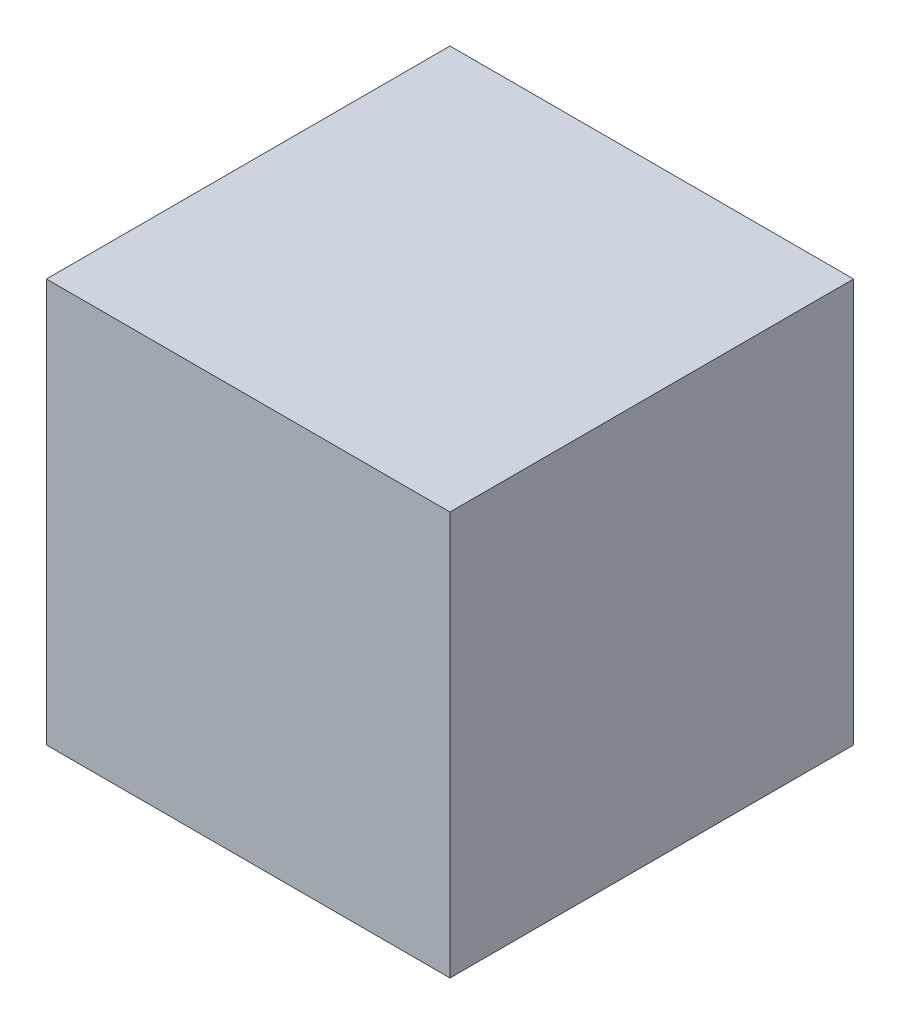
ISO-10303-21;
HEADER;
FILE_DESCRIPTION(('STEP AP214'),'2;1');
FILE_NAME('part.step','',(''),(''),'','','');
FILE_SCHEMA(('AUTOMOTIVE_DESIGN { 1 0 10303 214 1 1 1 1 }'));
ENDSEC;
DATA;
#1=APPLICATION_CONTEXT('core data for automotive mechanical design processes');
#2=APPLICATION_PROTOCOL_DEFINITION('international standard','automotive_design',2000,#1);
#3=PRODUCT_CONTEXT('',#1,'mechanical');
#4=PRODUCT('Part','Part','',(#3));
#5=PRODUCT_RELATED_PRODUCT_CATEGORY('part','',(#4));
#6=PRODUCT_DEFINITION_FORMATION('','',#4);
#7=PRODUCT_DEFINITION_CONTEXT('part definition',#1,'design');
#8=PRODUCT_DEFINITION('design','',#6,#7);
#9=PRODUCT_DEFINITION_SHAPE('','',#8);
#10=(LENGTH_UNIT() NAMED_UNIT(*) SI_UNIT(.MILLI.,.METRE.));
#11=(NAMED_UNIT(*) PLANE_ANGLE_UNIT() SI_UNIT($,.RADIAN.));
#12=(NAMED_UNIT(*) SI_UNIT($,.STERADIAN.) SOLID_ANGLE_UNIT());
#13=UNCERTAINTY_MEASURE_WITH_UNIT(LENGTH_MEASURE(1.E-05),#10,'distance_accuracy_value','');
#14=(GEOMETRIC_REPRESENTATION_CONTEXT(3) GLOBAL_UNCERTAINTY_ASSIGNED_CONTEXT((#13)) GLOBAL_UNIT_ASSIGNED_CONTEXT((#10,
#11,#12)) REPRESENTATION_CONTEXT('',''));
#15=CARTESIAN_POINT('',(0.,0.,0.));
#16=DIRECTION('',(0.,0.,1.));
#17=DIRECTION('',(1.,0.,0.));
#18=AXIS2_PLACEMENT_3D('',#15,#16,#17);
#19=CARTESIAN_POINT('',(0.,0.,900.));
#20=DIRECTION('',(1.,0.,0.));
#21=DIRECTION('',(0.,0.,-1.));
#22=AXIS2_PLACEMENT_3D('',#19,#20,#21);
#23=PLANE('',#22);
#24=DIRECTION('',(0.,-1.,0.));
#25=VECTOR('',#24,1.);
#26=CARTESIAN_POINT('',(0.,0.,0.));
#27=LINE('',#26,#25);
#28=CARTESIAN_POINT('',(0.,900.,0.));
#29=VERTEX_POINT('',#28);
#30=CARTESIAN_POINT('',(0.,0.,0.));
#31=VERTEX_POINT('',#30);
#32=EDGE_CURVE('E108',#29,#31,#27,.T.);
#33=ORIENTED_EDGE('',*,*,#32,.T.);
#34=DIRECTION('',(0.,0.,-1.));
#35=VECTOR('',#34,1.);
#36=CARTESIAN_POINT('',(0.,0.,900.));
#37=LINE('',#36,#35);
#38=CARTESIAN_POINT('',(0.,0.,900.));
#39=VERTEX_POINT('',#38);
#40=EDGE_CURVE('E11',#39,#31,#37,.T.);
#41=ORIENTED_EDGE('',*,*,#40,.F.);
#42=DIRECTION('',(0.,-1.,0.));
#43=VECTOR('',#42,1.);
#44=CARTESIAN_POINT('',(0.,0.,900.));
#45=LINE('',#44,#43);
#46=CARTESIAN_POINT('',(0.,900.,900.));
#47=VERTEX_POINT('',#46);
#48=EDGE_CURVE('E96',#47,#39,#45,.T.);
#49=ORIENTED_EDGE('',*,*,#48,.F.);
#50=DIRECTION('',(0.,0.,-1.));
#51=VECTOR('',#50,1.);
#52=CARTESIAN_POINT('',(0.,900.,900.));
#53=LINE('',#52,#51);
#54=EDGE_CURVE('E104',#47,#29,#53,.T.);
#55=ORIENTED_EDGE('',*,*,#54,.T.);
#56=EDGE_LOOP('',(#33,#41,#49,#55));
#57=FACE_BOUND('',#56,.T.);
#58=ADVANCED_FACE('F45',(#57),#23,.F.);
#59=CARTESIAN_POINT('',(0.,0.,900.));
#60=DIRECTION('',(0.,1.,0.));
#61=DIRECTION('',(0.,0.,1.));
#62=AXIS2_PLACEMENT_3D('',#59,#60,#61);
#63=PLANE('',#62);
#64=DIRECTION('',(1.,0.,0.));
#65=VECTOR('',#64,1.);
#66=CARTESIAN_POINT('',(0.,0.,0.));
#67=LINE('',#66,#65);
#68=CARTESIAN_POINT('',(900.,0.,0.));
#69=VERTEX_POINT('',#68);
#70=EDGE_CURVE('E100',#31,#69,#67,.T.);
#71=ORIENTED_EDGE('',*,*,#70,.T.);
#72=DIRECTION('',(0.,0.,-1.));
#73=VECTOR('',#72,1.);
#74=CARTESIAN_POINT('',(900.,0.,900.));
#75=LINE('',#74,#73);
#76=CARTESIAN_POINT('',(900.,0.,900.));
#77=VERTEX_POINT('',#76);
#78=EDGE_CURVE('E53',#77,#69,#75,.T.);
#79=ORIENTED_EDGE('',*,*,#78,.F.);
#80=DIRECTION('',(1.,0.,0.));
#81=VECTOR('',#80,1.);
#82=CARTESIAN_POINT('',(0.,0.,900.));
#83=LINE('',#82,#81);
#84=EDGE_CURVE('E91',#39,#77,#83,.T.);
#85=ORIENTED_EDGE('',*,*,#84,.F.);
#86=ORIENTED_EDGE('',*,*,#40,.T.);
#87=EDGE_LOOP('',(#71,#79,#85,#86));
#88=FACE_BOUND('',#87,.T.);
#89=ADVANCED_FACE('F99',(#88),#63,.F.);
#90=CARTESIAN_POINT('',(900.,0.,900.));
#91=DIRECTION('',(-1.,0.,0.));
#92=DIRECTION('',(0.,0.,1.));
#93=AXIS2_PLACEMENT_3D('',#90,#91,#92);
#94=PLANE('',#93);
#95=DIRECTION('',(0.,1.,0.));
#96=VECTOR('',#95,1.);
#97=CARTESIAN_POINT('',(900.,0.,0.));
#98=LINE('',#97,#96);
#99=CARTESIAN_POINT('',(900.,900.,0.));
#100=VERTEX_POINT('',#99);
#101=EDGE_CURVE('E78',#69,#100,#98,.T.);
#102=ORIENTED_EDGE('',*,*,#101,.T.);
#103=DIRECTION('',(0.,0.,-1.));
#104=VECTOR('',#103,1.);
#105=CARTESIAN_POINT('',(900.,900.,900.));
#106=LINE('',#105,#104);
#107=CARTESIAN_POINT('',(900.,900.,900.));
#108=VERTEX_POINT('',#107);
#109=EDGE_CURVE('E101',#108,#100,#106,.T.);
#110=ORIENTED_EDGE('',*,*,#109,.F.);
#111=DIRECTION('',(0.,1.,0.));
#112=VECTOR('',#111,1.);
#113=CARTESIAN_POINT('',(900.,0.,900.));
#114=LINE('',#113,#112);
#115=EDGE_CURVE('E94',#77,#108,#114,.T.);
#116=ORIENTED_EDGE('',*,*,#115,.F.);
#117=ORIENTED_EDGE('',*,*,#78,.T.);
#118=EDGE_LOOP('',(#102,#110,#116,#117));
#119=FACE_BOUND('',#118,.T.);
#120=ADVANCED_FACE('F102',(#119),#94,.F.);
#121=CARTESIAN_POINT('',(0.,900.,900.));
#122=DIRECTION('',(0.,-1.,0.));
#123=DIRECTION('',(0.,0.,-1.));
#124=AXIS2_PLACEMENT_3D('',#121,#122,#123);
#125=PLANE('',#124);
#126=DIRECTION('',(-1.,0.,0.));
#127=VECTOR('',#126,1.);
#128=CARTESIAN_POINT('',(0.,900.,0.));
#129=LINE('',#128,#127);
#130=EDGE_CURVE('E84',#100,#29,#129,.T.);
#131=ORIENTED_EDGE('',*,*,#130,.T.);
#132=ORIENTED_EDGE('',*,*,#54,.F.);
#133=DIRECTION('',(-1.,0.,0.));
#134=VECTOR('',#133,1.);
#135=CARTESIAN_POINT('',(0.,900.,900.));
#136=LINE('',#135,#134);
#137=EDGE_CURVE('E61',#108,#47,#136,.T.);
#138=ORIENTED_EDGE('',*,*,#137,.F.);
#139=ORIENTED_EDGE('',*,*,#109,.T.);
#140=EDGE_LOOP('',(#131,#132,#138,#139));
#141=FACE_BOUND('',#140,.T.);
#142=ADVANCED_FACE('F115',(#141),#125,.F.);
#143=CARTESIAN_POINT('',(0.,0.,900.));
#144=DIRECTION('',(0.,0.,-1.));
#145=DIRECTION('',(-1.,0.,0.));
#146=AXIS2_PLACEMENT_3D('',#143,#144,#145);
#147=PLANE('',#146);
#148=ORIENTED_EDGE('',*,*,#48,.T.);
#149=ORIENTED_EDGE('',*,*,#84,.T.);
#150=ORIENTED_EDGE('',*,*,#115,.T.);
#151=ORIENTED_EDGE('',*,*,#137,.T.);
#152=EDGE_LOOP('',(#148,#149,#150,#151));
#153=FACE_BOUND('',#152,.T.);
#154=ADVANCED_FACE('F92',(#153),#147,.F.);
#155=CARTESIAN_POINT('',(0.,0.,0.));
#156=DIRECTION('',(0.,0.,-1.));
#157=DIRECTION('',(-1.,0.,0.));
#158=AXIS2_PLACEMENT_3D('',#155,#156,#157);
#159=PLANE('',#158);
#160=ORIENTED_EDGE('',*,*,#32,.F.);
#161=ORIENTED_EDGE('',*,*,#130,.F.);
#162=ORIENTED_EDGE('',*,*,#101,.F.);
#163=ORIENTED_EDGE('',*,*,#70,.F.);
#164=EDGE_LOOP('',(#160,#161,#162,#163));
#165=FACE_BOUND('',#164,.T.);
#166=ADVANCED_FACE('F118',(#165),#159,.T.);
#167=CLOSED_SHELL('',(#58,#89,#120,#142,#154,#166));
#168=MANIFOLD_SOLID_BREP('B2',#167);
#169=ADVANCED_BREP_SHAPE_REPRESENTATION('',(#18,#168),#14);
#170=SHAPE_DEFINITION_REPRESENTATION(#9,#169);
ENDSEC;
END-ISO-10303-21;
